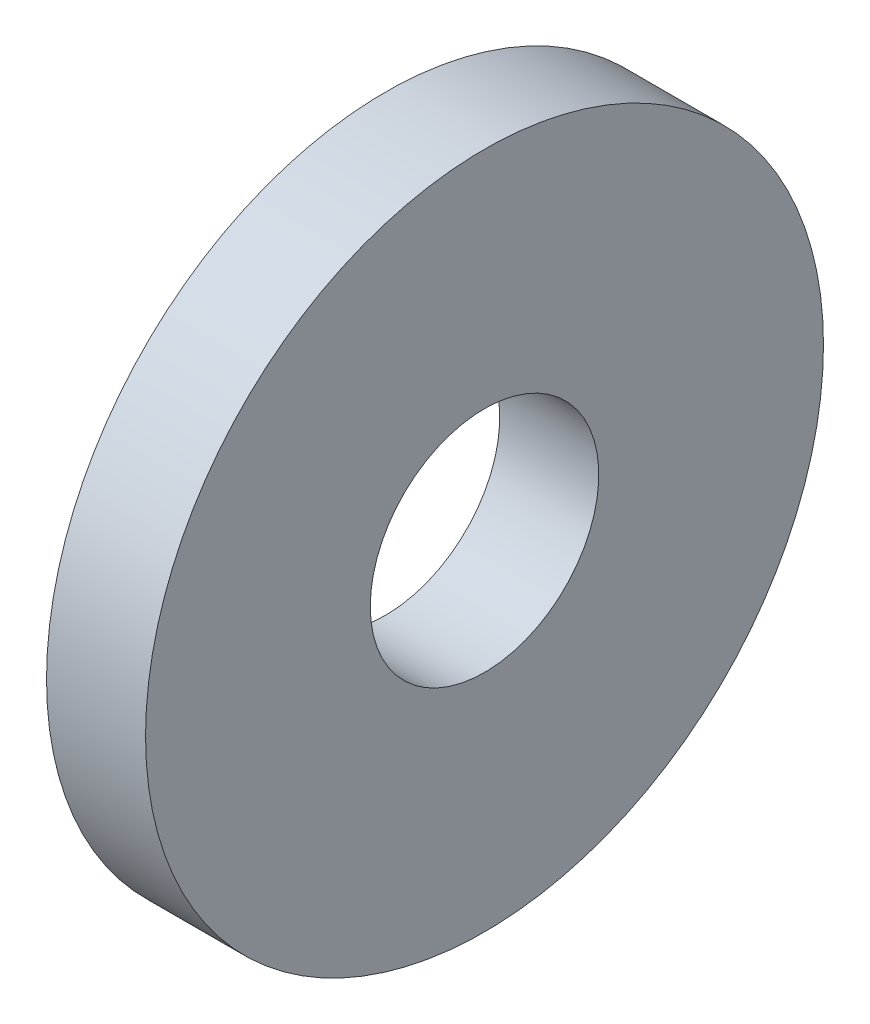
ISO-10303-21;
HEADER;
FILE_DESCRIPTION(('STEP AP214'),'2;1');
FILE_NAME('part.step','',(''),(''),'','','');
FILE_SCHEMA(('AUTOMOTIVE_DESIGN { 1 0 10303 214 1 1 1 1 }'));
ENDSEC;
DATA;
#1=APPLICATION_CONTEXT('core data for automotive mechanical design processes');
#2=APPLICATION_PROTOCOL_DEFINITION('international standard','automotive_design',2000,#1);
#3=PRODUCT_CONTEXT('',#1,'mechanical');
#4=PRODUCT('Part','Part','',(#3));
#5=PRODUCT_RELATED_PRODUCT_CATEGORY('part','',(#4));
#6=PRODUCT_DEFINITION_FORMATION('','',#4);
#7=PRODUCT_DEFINITION_CONTEXT('part definition',#1,'design');
#8=PRODUCT_DEFINITION('design','',#6,#7);
#9=PRODUCT_DEFINITION_SHAPE('','',#8);
#10=(LENGTH_UNIT() NAMED_UNIT(*) SI_UNIT(.MILLI.,.METRE.));
#11=(NAMED_UNIT(*) PLANE_ANGLE_UNIT() SI_UNIT($,.RADIAN.));
#12=(NAMED_UNIT(*) SI_UNIT($,.STERADIAN.) SOLID_ANGLE_UNIT());
#13=UNCERTAINTY_MEASURE_WITH_UNIT(LENGTH_MEASURE(1.E-05),#10,'distance_accuracy_value','');
#14=(GEOMETRIC_REPRESENTATION_CONTEXT(3) GLOBAL_UNCERTAINTY_ASSIGNED_CONTEXT((#13)) GLOBAL_UNIT_ASSIGNED_CONTEXT((#10,
#11,#12)) REPRESENTATION_CONTEXT('',''));
#15=CARTESIAN_POINT('',(0.,0.,0.));
#16=DIRECTION('',(0.,0.,1.));
#17=DIRECTION('',(1.,0.,0.));
#18=AXIS2_PLACEMENT_3D('',#15,#16,#17);
#19=CARTESIAN_POINT('',(0.,1.5,0.));
#20=DIRECTION('',(1.,0.,0.));
#21=DIRECTION('',(0.,0.,-1.));
#22=AXIS2_PLACEMENT_3D('',#19,#20,#21);
#23=PLANE('',#22);
#24=CARTESIAN_POINT('',(0.,0.,0.));
#25=DIRECTION('',(-1.,0.,0.));
#26=DIRECTION('',(0.,0.,1.));
#27=AXIS2_PLACEMENT_3D('',#24,#25,#26);
#28=CIRCLE('',#27,1.5);
#29=CARTESIAN_POINT('',(0.,0.,1.5));
#30=VERTEX_POINT('',#29);
#31=EDGE_CURVE('E44',#30,#30,#28,.T.);
#32=ORIENTED_EDGE('',*,*,#31,.F.);
#33=EDGE_LOOP('',(#32));
#34=FACE_BOUND('',#33,.T.);
#35=CARTESIAN_POINT('',(0.,0.,0.));
#36=DIRECTION('',(-1.,0.,0.));
#37=DIRECTION('',(0.,0.,1.));
#38=AXIS2_PLACEMENT_3D('',#35,#36,#37);
#39=CIRCLE('',#38,4.45);
#40=CARTESIAN_POINT('',(0.,0.,4.45));
#41=VERTEX_POINT('',#40);
#42=EDGE_CURVE('E10',#41,#41,#39,.T.);
#43=ORIENTED_EDGE('',*,*,#42,.T.);
#44=EDGE_LOOP('',(#43));
#45=FACE_BOUND('',#44,.T.);
#46=ADVANCED_FACE('F30',(#34,#45),#23,.F.);
#47=CARTESIAN_POINT('',(-18.0268479451757,0.,0.));
#48=DIRECTION('',(-1.,0.,0.));
#49=DIRECTION('',(0.,0.,1.));
#50=AXIS2_PLACEMENT_3D('',#47,#48,#49);
#51=CYLINDRICAL_SURFACE('',#50,4.45);
#52=ORIENTED_EDGE('',*,*,#42,.F.);
#53=EDGE_LOOP('',(#52));
#54=FACE_BOUND('',#53,.T.);
#55=CARTESIAN_POINT('',(1.3,0.,0.));
#56=DIRECTION('',(-1.,0.,0.));
#57=DIRECTION('',(0.,0.,1.));
#58=AXIS2_PLACEMENT_3D('',#55,#56,#57);
#59=CIRCLE('',#58,4.45);
#60=CARTESIAN_POINT('',(1.3,0.,4.45));
#61=VERTEX_POINT('',#60);
#62=EDGE_CURVE('E36',#61,#61,#59,.T.);
#63=ORIENTED_EDGE('',*,*,#62,.T.);
#64=EDGE_LOOP('',(#63));
#65=FACE_BOUND('',#64,.T.);
#66=ADVANCED_FACE('F53',(#54,#65),#51,.T.);
#67=CARTESIAN_POINT('',(1.3,1.5,0.));
#68=DIRECTION('',(-1.,0.,0.));
#69=DIRECTION('',(0.,0.,1.));
#70=AXIS2_PLACEMENT_3D('',#67,#68,#69);
#71=PLANE('',#70);
#72=ORIENTED_EDGE('',*,*,#62,.F.);
#73=EDGE_LOOP('',(#72));
#74=FACE_BOUND('',#73,.T.);
#75=CARTESIAN_POINT('',(1.3,0.,0.));
#76=DIRECTION('',(-1.,0.,0.));
#77=DIRECTION('',(0.,0.,1.));
#78=AXIS2_PLACEMENT_3D('',#75,#76,#77);
#79=CIRCLE('',#78,1.5);
#80=CARTESIAN_POINT('',(1.3,0.,1.5));
#81=VERTEX_POINT('',#80);
#82=EDGE_CURVE('E40',#81,#81,#79,.T.);
#83=ORIENTED_EDGE('',*,*,#82,.T.);
#84=EDGE_LOOP('',(#83));
#85=FACE_BOUND('',#84,.T.);
#86=ADVANCED_FACE('F57',(#74,#85),#71,.F.);
#87=CARTESIAN_POINT('',(-18.0268479451757,0.,0.));
#88=DIRECTION('',(-1.,0.,0.));
#89=DIRECTION('',(0.,0.,1.));
#90=AXIS2_PLACEMENT_3D('',#87,#88,#89);
#91=CYLINDRICAL_SURFACE('',#90,1.5);
#92=ORIENTED_EDGE('',*,*,#82,.F.);
#93=EDGE_LOOP('',(#92));
#94=FACE_BOUND('',#93,.T.);
#95=ORIENTED_EDGE('',*,*,#31,.T.);
#96=EDGE_LOOP('',(#95));
#97=FACE_BOUND('',#96,.T.);
#98=ADVANCED_FACE('F50',(#94,#97),#91,.F.);
#99=CLOSED_SHELL('',(#46,#66,#86,#98));
#100=MANIFOLD_SOLID_BREP('B2',#99);
#101=ADVANCED_BREP_SHAPE_REPRESENTATION('',(#18,#100),#14);
#102=SHAPE_DEFINITION_REPRESENTATION(#9,#101);
ENDSEC;
END-ISO-10303-21;
